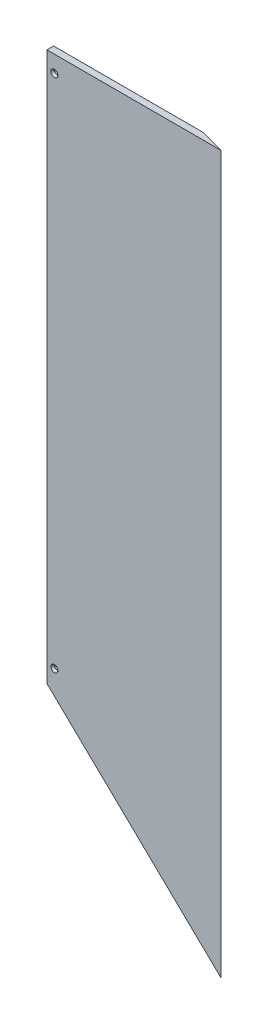
ISO-10303-21;
HEADER;
FILE_DESCRIPTION(('STEP AP214'),'2;1');
FILE_NAME('part.step','',(''),(''),'','','');
FILE_SCHEMA(('AUTOMOTIVE_DESIGN { 1 0 10303 214 1 1 1 1 }'));
ENDSEC;
DATA;
#1=APPLICATION_CONTEXT('core data for automotive mechanical design processes');
#2=APPLICATION_PROTOCOL_DEFINITION('international standard','automotive_design',2000,#1);
#3=PRODUCT_CONTEXT('',#1,'mechanical');
#4=PRODUCT('Part','Part','',(#3));
#5=PRODUCT_RELATED_PRODUCT_CATEGORY('part','',(#4));
#6=PRODUCT_DEFINITION_FORMATION('','',#4);
#7=PRODUCT_DEFINITION_CONTEXT('part definition',#1,'design');
#8=PRODUCT_DEFINITION('design','',#6,#7);
#9=PRODUCT_DEFINITION_SHAPE('','',#8);
#10=(LENGTH_UNIT() NAMED_UNIT(*) SI_UNIT(.MILLI.,.METRE.));
#11=(NAMED_UNIT(*) PLANE_ANGLE_UNIT() SI_UNIT($,.RADIAN.));
#12=(NAMED_UNIT(*) SI_UNIT($,.STERADIAN.) SOLID_ANGLE_UNIT());
#13=UNCERTAINTY_MEASURE_WITH_UNIT(LENGTH_MEASURE(1.E-05),#10,'distance_accuracy_value','');
#14=(GEOMETRIC_REPRESENTATION_CONTEXT(3) GLOBAL_UNCERTAINTY_ASSIGNED_CONTEXT((#13)) GLOBAL_UNIT_ASSIGNED_CONTEXT((#10,
#11,#12)) REPRESENTATION_CONTEXT('',''));
#15=CARTESIAN_POINT('',(0.,0.,0.));
#16=DIRECTION('',(0.,0.,1.));
#17=DIRECTION('',(1.,0.,0.));
#18=AXIS2_PLACEMENT_3D('',#15,#16,#17);
#19=CARTESIAN_POINT('',(1480.98408110292,1371.6,12.7020000000002));
#20=DIRECTION('',(0.,-1.,0.));
#21=DIRECTION('',(0.26471698178117,0.,-0.964326147917118));
#22=AXIS2_PLACEMENT_3D('',#19,#20,#21);
#23=PLANE('',#22);
#24=DIRECTION('',(-0.964326147917118,0.,-0.26471698178117));
#25=VECTOR('',#24,1.);
#26=CARTESIAN_POINT('',(61.2393104383737,1371.6,-422.666784086401));
#27=LINE('',#26,#25);
#28=CARTESIAN_POINT('',(1647.21830961026,1371.6,12.7000000000001));
#29=VERTEX_POINT('',#28);
#30=CARTESIAN_POINT('',(1600.95402389598,1371.6,1.11022302462516E-13));
#31=VERTEX_POINT('',#30);
#32=EDGE_CURVE('E116',#29,#31,#27,.T.);
#33=ORIENTED_EDGE('',*,*,#32,.T.);
#34=DIRECTION('',(1.,0.,0.));
#35=VECTOR('',#34,1.);
#36=CARTESIAN_POINT('',(1480.98408110292,1371.6,-1.11022302462516E-13));
#37=LINE('',#36,#35);
#38=CARTESIAN_POINT('',(1314.74985259558,1371.6,0.));
#39=VERTEX_POINT('',#38);
#40=EDGE_CURVE('E139',#39,#31,#37,.T.);
#41=ORIENTED_EDGE('',*,*,#40,.F.);
#42=DIRECTION('',(0.,0.,-1.));
#43=VECTOR('',#42,1.);
#44=CARTESIAN_POINT('',(1314.74985259558,1371.6,12.7019999999997));
#45=LINE('',#44,#43);
#46=CARTESIAN_POINT('',(1314.74985259558,1371.6,12.7000000000002));
#47=VERTEX_POINT('',#46);
#48=EDGE_CURVE('E117',#47,#39,#45,.T.);
#49=ORIENTED_EDGE('',*,*,#48,.F.);
#50=DIRECTION('',(1.,0.,0.));
#51=VECTOR('',#50,1.);
#52=CARTESIAN_POINT('',(1480.98408110292,1371.6,12.7));
#53=LINE('',#52,#51);
#54=EDGE_CURVE('E105',#47,#29,#53,.T.);
#55=ORIENTED_EDGE('',*,*,#54,.T.);
#56=EDGE_LOOP('',(#33,#41,#49,#55));
#57=FACE_BOUND('',#56,.T.);
#58=ADVANCED_FACE('F48',(#57),#23,.F.);
#59=CARTESIAN_POINT('',(1480.98408110292,687.420986771541,0.));
#60=DIRECTION('',(0.,0.,1.));
#61=DIRECTION('',(-1.,0.,0.));
#62=AXIS2_PLACEMENT_3D('',#59,#60,#61);
#63=PLANE('',#62);
#64=CARTESIAN_POINT('',(1329.03735259558,355.6,0.));
#65=DIRECTION('',(0.,0.,-1.));
#66=DIRECTION('',(-1.,0.,0.));
#67=AXIS2_PLACEMENT_3D('',#64,#65,#66);
#68=CIRCLE('',#67,3.3782);
#69=CARTESIAN_POINT('',(1325.65915259558,355.6,0.));
#70=VERTEX_POINT('',#69);
#71=EDGE_CURVE('E52',#70,#70,#68,.F.);
#72=ORIENTED_EDGE('',*,*,#71,.T.);
#73=EDGE_LOOP('',(#72));
#74=FACE_BOUND('',#73,.T.);
#75=CARTESIAN_POINT('',(1329.03735259558,1339.85,4.44089209850063E-13));
#76=DIRECTION('',(0.,0.,-1.));
#77=DIRECTION('',(-1.,0.,0.));
#78=AXIS2_PLACEMENT_3D('',#75,#76,#77);
#79=CIRCLE('',#78,3.3782);
#80=CARTESIAN_POINT('',(1325.65915259558,1339.85,4.44276737621152E-13));
#81=VERTEX_POINT('',#80);
#82=EDGE_CURVE('E124',#81,#81,#79,.F.);
#83=ORIENTED_EDGE('',*,*,#82,.T.);
#84=EDGE_LOOP('',(#83));
#85=FACE_BOUND('',#84,.T.);
#86=DIRECTION('',(0.,-1.,0.));
#87=VECTOR('',#86,1.);
#88=CARTESIAN_POINT('',(1600.95402389598,687.420986771541,1.11022302462516E-13));
#89=LINE('',#88,#87);
#90=CARTESIAN_POINT('',(1600.95402389598,47.8558339720756,1.66533453693773E-13));
#91=VERTEX_POINT('',#90);
#92=EDGE_CURVE('E111',#31,#91,#89,.T.);
#93=ORIENTED_EDGE('',*,*,#92,.T.);
#94=DIRECTION('',(0.719829752215674,-0.694150652110275,0.));
#95=VECTOR('',#94,1.);
#96=CARTESIAN_POINT('',(1480.98408110292,163.545986771541,1.11022302462516E-13));
#97=LINE('',#96,#95);
#98=CARTESIAN_POINT('',(1314.74985259558,323.85,0.));
#99=VERTEX_POINT('',#98);
#100=EDGE_CURVE('E136',#99,#91,#97,.T.);
#101=ORIENTED_EDGE('',*,*,#100,.F.);
#102=DIRECTION('',(0.,-1.,0.));
#103=VECTOR('',#102,1.);
#104=CARTESIAN_POINT('',(1314.74985259558,847.725,0.));
#105=LINE('',#104,#103);
#106=EDGE_CURVE('E58',#39,#99,#105,.T.);
#107=ORIENTED_EDGE('',*,*,#106,.F.);
#108=ORIENTED_EDGE('',*,*,#40,.T.);
#109=EDGE_LOOP('',(#93,#101,#107,#108));
#110=FACE_BOUND('',#109,.T.);
#111=ADVANCED_FACE('F157',(#74,#85,#110),#63,.F.);
#112=CARTESIAN_POINT('',(1480.98408110292,163.545986771541,12.7019999999999));
#113=DIRECTION('',(-0.694150652110275,-0.719829752215675,0.));
#114=DIRECTION('',(-0.706175147076652,0.680983159335232,-0.193852001158297));
#115=AXIS2_PLACEMENT_3D('',#112,#113,#114);
#116=PLANE('',#115);
#117=DIRECTION('',(0.719829752215674,-0.694150652110275,0.));
#118=VECTOR('',#117,1.);
#119=CARTESIAN_POINT('',(1480.98408110292,163.545986771541,12.6999999999998));
#120=LINE('',#119,#118);
#121=CARTESIAN_POINT('',(1314.74985259558,323.85,12.7000000000002));
#122=VERTEX_POINT('',#121);
#123=CARTESIAN_POINT('',(1647.21830961026,3.24197354308216,12.7000000000002));
#124=VERTEX_POINT('',#123);
#125=EDGE_CURVE('E108',#122,#124,#120,.T.);
#126=ORIENTED_EDGE('',*,*,#125,.F.);
#127=DIRECTION('',(0.,0.,-1.));
#128=VECTOR('',#127,1.);
#129=CARTESIAN_POINT('',(1314.74985259558,323.85,12.7019999999998));
#130=LINE('',#129,#128);
#131=EDGE_CURVE('E140',#122,#99,#130,.T.);
#132=ORIENTED_EDGE('',*,*,#131,.T.);
#133=ORIENTED_EDGE('',*,*,#100,.T.);
#134=DIRECTION('',(-0.706175147076652,0.680983159335232,-0.193852001158297));
#135=VECTOR('',#134,1.);
#136=CARTESIAN_POINT('',(1487.23120419546,157.521722624146,-31.2180289373961));
#137=LINE('',#136,#135);
#138=EDGE_CURVE('E11',#124,#91,#137,.T.);
#139=ORIENTED_EDGE('',*,*,#138,.F.);
#140=EDGE_LOOP('',(#126,#132,#133,#139));
#141=FACE_BOUND('',#140,.T.);
#142=ADVANCED_FACE('F50',(#141),#116,.T.);
#143=CARTESIAN_POINT('',(1311.38794692696,660.4,12.7000000000001));
#144=DIRECTION('',(0.,0.,1.));
#145=DIRECTION('',(0.,1.,0.));
#146=AXIS2_PLACEMENT_3D('',#143,#144,#145);
#147=PLANE('',#146);
#148=CARTESIAN_POINT('',(1329.03735259558,355.6,12.7000000000012));
#149=DIRECTION('',(0.,0.,-1.));
#150=DIRECTION('',(-1.,0.,0.));
#151=AXIS2_PLACEMENT_3D('',#148,#149,#150);
#152=CIRCLE('',#151,6.7437);
#153=CARTESIAN_POINT('',(1322.29365259558,355.6,12.7000000000012));
#154=VERTEX_POINT('',#153);
#155=EDGE_CURVE('E203',#154,#154,#152,.T.);
#156=ORIENTED_EDGE('',*,*,#155,.T.);
#157=EDGE_LOOP('',(#156));
#158=FACE_BOUND('',#157,.T.);
#159=CARTESIAN_POINT('',(1329.03735259558,1339.85,12.7000000000003));
#160=DIRECTION('',(0.,0.,-1.));
#161=DIRECTION('',(-1.,0.,0.));
#162=AXIS2_PLACEMENT_3D('',#159,#160,#161);
#163=CIRCLE('',#162,6.74369999999991);
#164=CARTESIAN_POINT('',(1322.29365259558,1339.85,12.7000000000003));
#165=VERTEX_POINT('',#164);
#166=EDGE_CURVE('E212',#165,#165,#163,.T.);
#167=ORIENTED_EDGE('',*,*,#166,.T.);
#168=EDGE_LOOP('',(#167));
#169=FACE_BOUND('',#168,.T.);
#170=DIRECTION('',(0.,-1.,0.));
#171=VECTOR('',#170,1.);
#172=CARTESIAN_POINT('',(1314.74985259558,847.725,12.7));
#173=LINE('',#172,#171);
#174=EDGE_CURVE('E119',#47,#122,#173,.T.);
#175=ORIENTED_EDGE('',*,*,#174,.T.);
#176=ORIENTED_EDGE('',*,*,#125,.T.);
#177=DIRECTION('',(0.,-1.,0.));
#178=VECTOR('',#177,1.);
#179=CARTESIAN_POINT('',(1647.21830961026,687.420986771541,12.7));
#180=LINE('',#179,#178);
#181=EDGE_CURVE('E102',#29,#124,#180,.T.);
#182=ORIENTED_EDGE('',*,*,#181,.F.);
#183=ORIENTED_EDGE('',*,*,#54,.F.);
#184=EDGE_LOOP('',(#175,#176,#182,#183));
#185=FACE_BOUND('',#184,.T.);
#186=ADVANCED_FACE('F104',(#158,#169,#185),#147,.T.);
#187=CARTESIAN_POINT('',(1314.74985259558,847.725,12.7019999999997));
#188=DIRECTION('',(-1.,0.,0.));
#189=DIRECTION('',(0.,0.,-1.));
#190=AXIS2_PLACEMENT_3D('',#187,#188,#189);
#191=PLANE('',#190);
#192=ORIENTED_EDGE('',*,*,#48,.T.);
#193=ORIENTED_EDGE('',*,*,#106,.T.);
#194=ORIENTED_EDGE('',*,*,#131,.F.);
#195=ORIENTED_EDGE('',*,*,#174,.F.);
#196=EDGE_LOOP('',(#192,#193,#194,#195));
#197=FACE_BOUND('',#196,.T.);
#198=ADVANCED_FACE('F156',(#197),#191,.T.);
#199=CARTESIAN_POINT('',(61.2393104383733,685.8,-422.666784086401));
#200=DIRECTION('',(0.26471698178117,0.,-0.964326147917118));
#201=DIRECTION('',(-0.964326147917118,0.,-0.26471698178117));
#202=AXIS2_PLACEMENT_3D('',#199,#200,#201);
#203=PLANE('',#202);
#204=ORIENTED_EDGE('',*,*,#92,.F.);
#205=ORIENTED_EDGE('',*,*,#32,.F.);
#206=ORIENTED_EDGE('',*,*,#181,.T.);
#207=ORIENTED_EDGE('',*,*,#138,.T.);
#208=EDGE_LOOP('',(#204,#205,#206,#207));
#209=FACE_BOUND('',#208,.T.);
#210=ADVANCED_FACE('F121',(#209),#203,.T.);
#211=CARTESIAN_POINT('',(1329.03735259558,1339.85,-3550.01233949683));
#212=DIRECTION('',(0.,0.,1.));
#213=DIRECTION('',(-1.,0.,0.));
#214=AXIS2_PLACEMENT_3D('',#211,#212,#213);
#215=CYLINDRICAL_SURFACE('',#214,3.3782);
#216=CARTESIAN_POINT('',(1329.03735259558,1339.85,8.8284351254978));
#217=DIRECTION('',(0.,0.,-1.));
#218=DIRECTION('',(-1.,0.,0.));
#219=AXIS2_PLACEMENT_3D('',#216,#217,#218);
#220=CIRCLE('',#219,3.3782);
#221=CARTESIAN_POINT('',(1325.65915259558,1339.85,8.8284351254978));
#222=VERTEX_POINT('',#221);
#223=EDGE_CURVE('E132',#222,#222,#220,.T.);
#224=ORIENTED_EDGE('',*,*,#223,.F.);
#225=EDGE_LOOP('',(#224));
#226=FACE_BOUND('',#225,.T.);
#227=ORIENTED_EDGE('',*,*,#82,.F.);
#228=EDGE_LOOP('',(#227));
#229=FACE_BOUND('',#228,.T.);
#230=ADVANCED_FACE('F177',(#226,#229),#215,.F.);
#231=CARTESIAN_POINT('',(1329.03735259558,1339.85,8.8284351254978));
#232=DIRECTION('',(0.,0.,1.));
#233=DIRECTION('',(-1.,0.,0.));
#234=AXIS2_PLACEMENT_3D('',#231,#232,#233);
#235=CONICAL_SURFACE('',#234,3.3782,0.715584993317624);
#236=ORIENTED_EDGE('',*,*,#166,.F.);
#237=EDGE_LOOP('',(#236));
#238=FACE_BOUND('',#237,.T.);
#239=ORIENTED_EDGE('',*,*,#223,.T.);
#240=EDGE_LOOP('',(#239));
#241=FACE_BOUND('',#240,.T.);
#242=ADVANCED_FACE('F181',(#238,#241),#235,.F.);
#243=CARTESIAN_POINT('',(1329.03735259558,355.6,-3550.01233949683));
#244=DIRECTION('',(0.,0.,1.));
#245=DIRECTION('',(-1.,0.,0.));
#246=AXIS2_PLACEMENT_3D('',#243,#244,#245);
#247=CYLINDRICAL_SURFACE('',#246,3.3782);
#248=CARTESIAN_POINT('',(1329.03735259558,355.6,8.8284351254978));
#249=DIRECTION('',(0.,0.,-1.));
#250=DIRECTION('',(-1.,0.,0.));
#251=AXIS2_PLACEMENT_3D('',#248,#249,#250);
#252=CIRCLE('',#251,3.3782);
#253=CARTESIAN_POINT('',(1325.65915259558,355.6,8.8284351254978));
#254=VERTEX_POINT('',#253);
#255=EDGE_CURVE('E206',#254,#254,#252,.T.);
#256=ORIENTED_EDGE('',*,*,#255,.F.);
#257=EDGE_LOOP('',(#256));
#258=FACE_BOUND('',#257,.T.);
#259=ORIENTED_EDGE('',*,*,#71,.F.);
#260=EDGE_LOOP('',(#259));
#261=FACE_BOUND('',#260,.T.);
#262=ADVANCED_FACE('F186',(#258,#261),#247,.F.);
#263=CARTESIAN_POINT('',(1329.03735259558,355.6,8.8284351254978));
#264=DIRECTION('',(0.,0.,1.));
#265=DIRECTION('',(-1.,0.,0.));
#266=AXIS2_PLACEMENT_3D('',#263,#264,#265);
#267=CONICAL_SURFACE('',#266,3.3782,0.715584993317523);
#268=ORIENTED_EDGE('',*,*,#155,.F.);
#269=EDGE_LOOP('',(#268));
#270=FACE_BOUND('',#269,.T.);
#271=ORIENTED_EDGE('',*,*,#255,.T.);
#272=EDGE_LOOP('',(#271));
#273=FACE_BOUND('',#272,.T.);
#274=ADVANCED_FACE('F194',(#270,#273),#267,.F.);
#275=CLOSED_SHELL('',(#58,#111,#142,#186,#198,#210,#230,#242,#262,#274));
#276=MANIFOLD_SOLID_BREP('B2',#275);
#277=ADVANCED_BREP_SHAPE_REPRESENTATION('',(#18,#276),#14);
#278=SHAPE_DEFINITION_REPRESENTATION(#9,#277);
ENDSEC;
END-ISO-10303-21;
